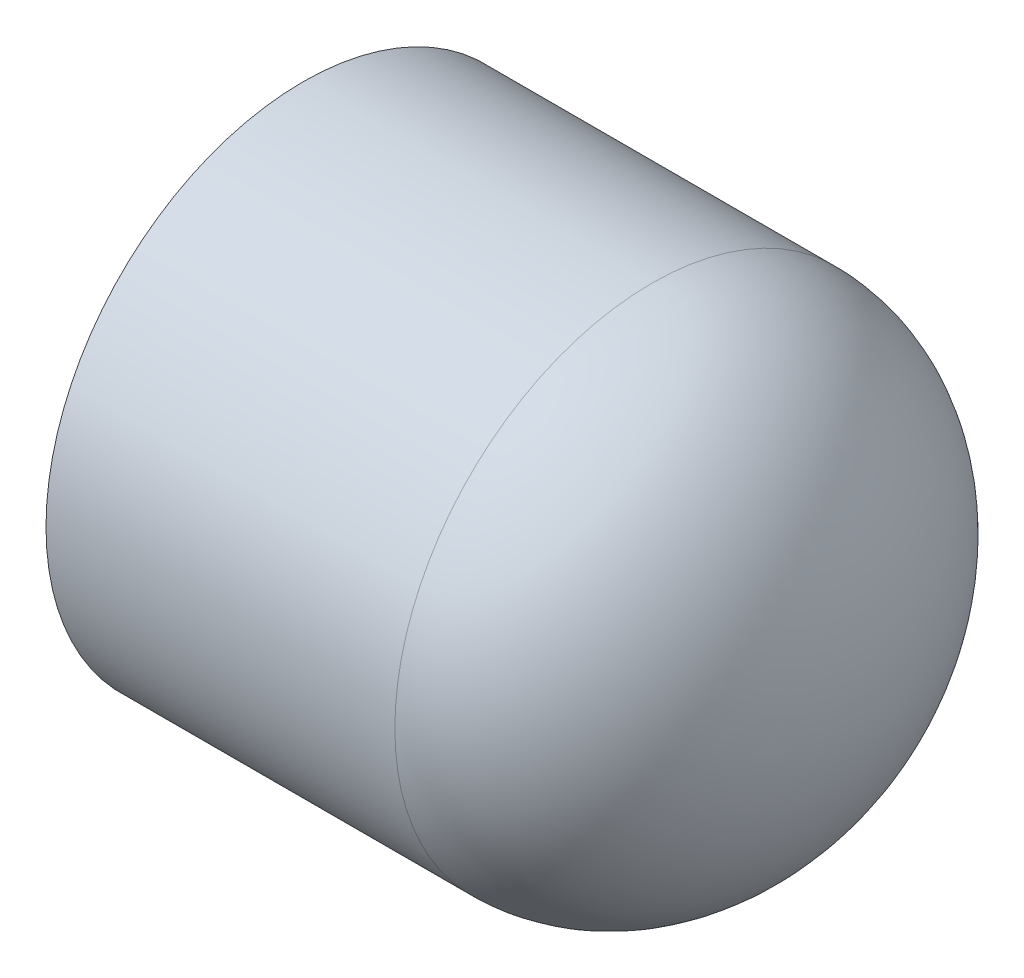
ISO-10303-21;
HEADER;
FILE_DESCRIPTION(('STEP AP214'),'2;1');
FILE_NAME('part.step','',(''),(''),'','','');
FILE_SCHEMA(('AUTOMOTIVE_DESIGN { 1 0 10303 214 1 1 1 1 }'));
ENDSEC;
DATA;
#1=APPLICATION_CONTEXT('core data for automotive mechanical design processes');
#2=APPLICATION_PROTOCOL_DEFINITION('international standard','automotive_design',2000,#1);
#3=PRODUCT_CONTEXT('',#1,'mechanical');
#4=PRODUCT('Part','Part','',(#3));
#5=PRODUCT_RELATED_PRODUCT_CATEGORY('part','',(#4));
#6=PRODUCT_DEFINITION_FORMATION('','',#4);
#7=PRODUCT_DEFINITION_CONTEXT('part definition',#1,'design');
#8=PRODUCT_DEFINITION('design','',#6,#7);
#9=PRODUCT_DEFINITION_SHAPE('','',#8);
#10=(LENGTH_UNIT() NAMED_UNIT(*) SI_UNIT(.MILLI.,.METRE.));
#11=(NAMED_UNIT(*) PLANE_ANGLE_UNIT() SI_UNIT($,.RADIAN.));
#12=(NAMED_UNIT(*) SI_UNIT($,.STERADIAN.) SOLID_ANGLE_UNIT());
#13=UNCERTAINTY_MEASURE_WITH_UNIT(LENGTH_MEASURE(1.E-05),#10,'distance_accuracy_value','');
#14=(GEOMETRIC_REPRESENTATION_CONTEXT(3) GLOBAL_UNCERTAINTY_ASSIGNED_CONTEXT((#13)) GLOBAL_UNIT_ASSIGNED_CONTEXT((#10,
#11,#12)) REPRESENTATION_CONTEXT('',''));
#15=CARTESIAN_POINT('',(0.,0.,0.));
#16=DIRECTION('',(0.,0.,1.));
#17=DIRECTION('',(1.,0.,0.));
#18=AXIS2_PLACEMENT_3D('',#15,#16,#17);
#19=CARTESIAN_POINT('',(-22.0091,0.,0.));
#20=DIRECTION('',(-1.,0.,0.));
#21=DIRECTION('',(0.,0.,1.));
#22=AXIS2_PLACEMENT_3D('',#19,#20,#21);
#23=CYLINDRICAL_SURFACE('',#22,20.5867);
#24=CARTESIAN_POINT('',(5.9309,0.,0.));
#25=DIRECTION('',(-1.,0.,0.));
#26=DIRECTION('',(0.,0.,1.));
#27=AXIS2_PLACEMENT_3D('',#24,#25,#26);
#28=CIRCLE('',#27,20.5867);
#29=CARTESIAN_POINT('',(5.9309,0.,20.5867));
#30=VERTEX_POINT('',#29);
#31=EDGE_CURVE('E11',#30,#30,#28,.T.);
#32=ORIENTED_EDGE('',*,*,#31,.T.);
#33=EDGE_LOOP('',(#32));
#34=FACE_BOUND('',#33,.T.);
#35=CARTESIAN_POINT('',(-22.0091,0.,0.));
#36=DIRECTION('',(-1.,0.,0.));
#37=DIRECTION('',(0.,0.,1.));
#38=AXIS2_PLACEMENT_3D('',#35,#36,#37);
#39=CIRCLE('',#38,20.5867);
#40=CARTESIAN_POINT('',(-22.0091,0.,20.5867));
#41=VERTEX_POINT('',#40);
#42=EDGE_CURVE('E55',#41,#41,#39,.T.);
#43=ORIENTED_EDGE('',*,*,#42,.F.);
#44=EDGE_LOOP('',(#43));
#45=FACE_BOUND('',#44,.T.);
#46=ADVANCED_FACE('F32',(#34,#45),#23,.T.);
#47=CARTESIAN_POINT('',(5.9309,0.,0.));
#48=DIRECTION('',(0.,0.,1.));
#49=DIRECTION('',(0.,1.,0.));
#50=AXIS2_PLACEMENT_3D('',#47,#48,#49);
#51=ELLIPSE('',#50,20.5867,16.0782);
#52=TRIMMED_CURVE('',#51,(PARAMETER_VALUE(1.5707963267949)),(PARAMETER_VALUE(4.71238898038469)),
.T.,.PARAMETER.);
#53=CARTESIAN_POINT('',(-22.0091,0.,0.));
#54=DIRECTION('',(-1.,0.,0.));
#55=AXIS1_PLACEMENT('',#53,#54);
#56=SURFACE_OF_REVOLUTION('',#52,#55);
#57=CARTESIAN_POINT('',(22.0091,0.,0.));
#58=VERTEX_POINT('',#57);
#59=VERTEX_LOOP('',#58);
#60=FACE_BOUND('',#59,.T.);
#61=ORIENTED_EDGE('',*,*,#31,.F.);
#62=EDGE_LOOP('',(#61));
#63=FACE_BOUND('',#62,.T.);
#64=ADVANCED_FACE('F45',(#60,#63),#56,.F.);
#65=CARTESIAN_POINT('',(5.9309,0.,0.));
#66=DIRECTION('',(0.,0.,-1.));
#67=DIRECTION('',(0.,-1.,0.));
#68=AXIS2_PLACEMENT_3D('',#65,#66,#67);
#69=ELLIPSE('',#68,16.637,12.1285);
#70=TRIMMED_CURVE('',#69,(PARAMETER_VALUE(4.71238898038469)),
(PARAMETER_VALUE(7.85398163397448)),.T.,.PARAMETER.);
#71=CARTESIAN_POINT('',(-22.0091,0.,0.));
#72=DIRECTION('',(-1.,0.,0.));
#73=AXIS1_PLACEMENT('',#71,#72);
#74=SURFACE_OF_REVOLUTION('',#70,#73);
#75=CARTESIAN_POINT('',(5.9309,0.,0.));
#76=DIRECTION('',(-1.,0.,0.));
#77=DIRECTION('',(0.,0.,1.));
#78=AXIS2_PLACEMENT_3D('',#75,#76,#77);
#79=CIRCLE('',#78,16.637);
#80=CARTESIAN_POINT('',(5.9309,0.,16.637));
#81=VERTEX_POINT('',#80);
#82=EDGE_CURVE('E39',#81,#81,#79,.T.);
#83=ORIENTED_EDGE('',*,*,#82,.T.);
#84=EDGE_LOOP('',(#83));
#85=FACE_BOUND('',#84,.T.);
#86=CARTESIAN_POINT('',(18.0594,0.,0.));
#87=VERTEX_POINT('',#86);
#88=VERTEX_LOOP('',#87);
#89=FACE_BOUND('',#88,.T.);
#90=ADVANCED_FACE('F48',(#85,#89),#74,.F.);
#91=CARTESIAN_POINT('',(5.9309,0.,0.));
#92=DIRECTION('',(-1.,0.,0.));
#93=DIRECTION('',(0.,0.,1.));
#94=AXIS2_PLACEMENT_3D('',#91,#92,#93);
#95=CONICAL_SURFACE('',#94,16.637,0.00681807616748478);
#96=CARTESIAN_POINT('',(-22.0091,0.,0.));
#97=DIRECTION('',(-1.,0.,0.));
#98=DIRECTION('',(0.,0.,1.));
#99=AXIS2_PLACEMENT_3D('',#96,#97,#98);
#100=CIRCLE('',#99,16.8275);
#101=CARTESIAN_POINT('',(-22.0091,0.,16.8275));
#102=VERTEX_POINT('',#101);
#103=EDGE_CURVE('E57',#102,#102,#100,.T.);
#104=ORIENTED_EDGE('',*,*,#103,.T.);
#105=EDGE_LOOP('',(#104));
#106=FACE_BOUND('',#105,.T.);
#107=ORIENTED_EDGE('',*,*,#82,.F.);
#108=EDGE_LOOP('',(#107));
#109=FACE_BOUND('',#108,.T.);
#110=ADVANCED_FACE('F68',(#106,#109),#95,.F.);
#111=CARTESIAN_POINT('',(-22.0091,-20.5867,0.));
#112=DIRECTION('',(-1.,0.,0.));
#113=DIRECTION('',(0.,0.,1.));
#114=AXIS2_PLACEMENT_3D('',#111,#112,#113);
#115=PLANE('',#114);
#116=ORIENTED_EDGE('',*,*,#42,.T.);
#117=EDGE_LOOP('',(#116));
#118=FACE_BOUND('',#117,.T.);
#119=ORIENTED_EDGE('',*,*,#103,.F.);
#120=EDGE_LOOP('',(#119));
#121=FACE_BOUND('',#120,.T.);
#122=ADVANCED_FACE('F70',(#118,#121),#115,.T.);
#123=CLOSED_SHELL('',(#46,#64,#90,#110,#122));
#124=MANIFOLD_SOLID_BREP('B2',#123);
#125=ADVANCED_BREP_SHAPE_REPRESENTATION('',(#18,#124),#14);
#126=SHAPE_DEFINITION_REPRESENTATION(#9,#125);
ENDSEC;
END-ISO-10303-21;
